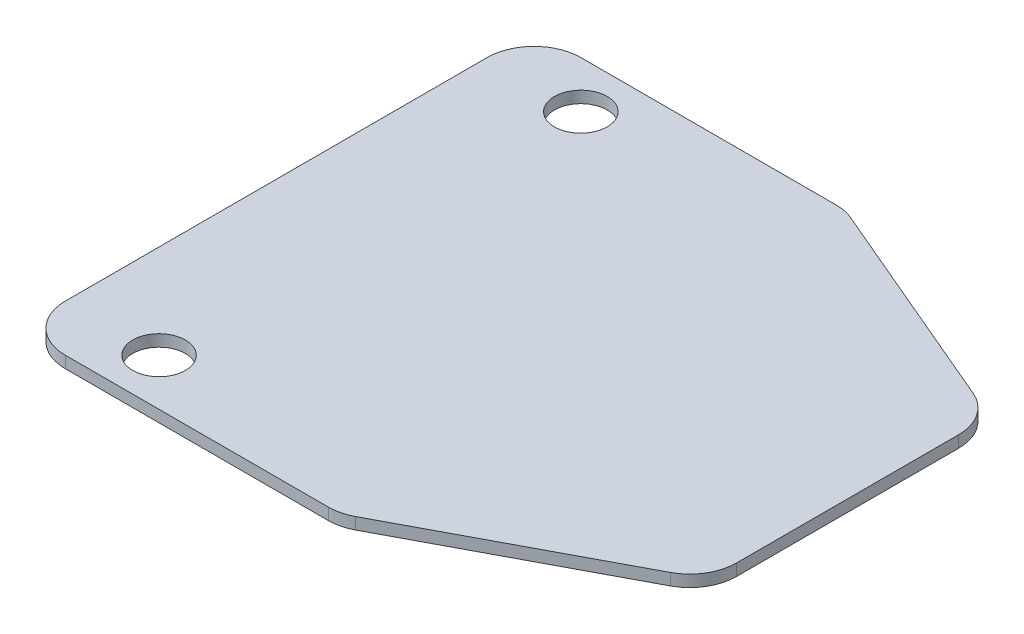
ISO-10303-21;
HEADER;
FILE_DESCRIPTION(('STEP AP214'),'2;1');
FILE_NAME('part.step','',(''),(''),'','','');
FILE_SCHEMA(('AUTOMOTIVE_DESIGN { 1 0 10303 214 1 1 1 1 }'));
ENDSEC;
DATA;
#1=APPLICATION_CONTEXT('core data for automotive mechanical design processes');
#2=APPLICATION_PROTOCOL_DEFINITION('international standard','automotive_design',2000,#1);
#3=PRODUCT_CONTEXT('',#1,'mechanical');
#4=PRODUCT('Part','Part','',(#3));
#5=PRODUCT_RELATED_PRODUCT_CATEGORY('part','',(#4));
#6=PRODUCT_DEFINITION_FORMATION('','',#4);
#7=PRODUCT_DEFINITION_CONTEXT('part definition',#1,'design');
#8=PRODUCT_DEFINITION('design','',#6,#7);
#9=PRODUCT_DEFINITION_SHAPE('','',#8);
#10=(LENGTH_UNIT() NAMED_UNIT(*) SI_UNIT(.MILLI.,.METRE.));
#11=(NAMED_UNIT(*) PLANE_ANGLE_UNIT() SI_UNIT($,.RADIAN.));
#12=(NAMED_UNIT(*) SI_UNIT($,.STERADIAN.) SOLID_ANGLE_UNIT());
#13=UNCERTAINTY_MEASURE_WITH_UNIT(LENGTH_MEASURE(1.E-05),#10,'distance_accuracy_value','');
#14=(GEOMETRIC_REPRESENTATION_CONTEXT(3) GLOBAL_UNCERTAINTY_ASSIGNED_CONTEXT((#13)) GLOBAL_UNIT_ASSIGNED_CONTEXT((#10,
#11,#12)) REPRESENTATION_CONTEXT('',''));
#15=CARTESIAN_POINT('',(0.,0.,0.));
#16=DIRECTION('',(0.,0.,1.));
#17=DIRECTION('',(1.,0.,0.));
#18=AXIS2_PLACEMENT_3D('',#15,#16,#17);
#19=CARTESIAN_POINT('',(0.,6.35,0.));
#20=DIRECTION('',(0.,-1.,0.));
#21=DIRECTION('',(0.,0.,-1.));
#22=AXIS2_PLACEMENT_3D('',#19,#20,#21);
#23=PLANE('',#22);
#24=DIRECTION('',(0.,0.,-1.));
#25=VECTOR('',#24,1.);
#26=CARTESIAN_POINT('',(4.75989238864277,6.35,-211.625159329348));
#27=LINE('',#26,#25);
#28=CARTESIAN_POINT('',(4.75989238864278,6.35,-74.5171086223627));
#29=VERTEX_POINT('',#28);
#30=CARTESIAN_POINT('',(4.75989238864277,6.35,-194.830999422839));
#31=VERTEX_POINT('',#30);
#32=EDGE_CURVE('E268',#29,#31,#27,.T.);
#33=ORIENTED_EDGE('',*,*,#32,.T.);
#34=CARTESIAN_POINT('',(-20.6401076113572,6.35,-194.830999422839));
#35=DIRECTION('',(0.,-1.,0.));
#36=DIRECTION('',(0.,0.,-1.));
#37=AXIS2_PLACEMENT_3D('',#34,#35,#36);
#38=CIRCLE('',#37,25.4);
#39=CARTESIAN_POINT('',(-10.6928325529594,6.35,-218.202172241347));
#40=VERTEX_POINT('',#39);
#41=EDGE_CURVE('E214',#31,#40,#38,.F.);
#42=ORIENTED_EDGE('',*,*,#41,.T.);
#43=DIRECTION('',(-0.920124914114497,0.,-0.391625002299125));
#44=VECTOR('',#43,1.);
#45=CARTESIAN_POINT('',(-131.188630818444,6.35,-269.487781998114));
#46=LINE('',#45,#44);
#47=CARTESIAN_POINT('',(-126.421891143592,6.35,-267.458954816622));
#48=VERTEX_POINT('',#47);
#49=EDGE_CURVE('E155',#40,#48,#46,.T.);
#50=ORIENTED_EDGE('',*,*,#49,.T.);
#51=CARTESIAN_POINT('',(-136.369166201989,6.35,-244.087781998114));
#52=DIRECTION('',(0.,-1.,0.));
#53=DIRECTION('',(0.,0.,-1.));
#54=AXIS2_PLACEMENT_3D('',#51,#52,#53);
#55=CIRCLE('',#54,25.4);
#56=CARTESIAN_POINT('',(-136.369166201989,6.35,-269.487781998114));
#57=VERTEX_POINT('',#56);
#58=EDGE_CURVE('E211',#48,#57,#55,.F.);
#59=ORIENTED_EDGE('',*,*,#58,.T.);
#60=DIRECTION('',(-1.,0.,0.));
#61=VECTOR('',#60,1.);
#62=CARTESIAN_POINT('',(-300.040107611357,6.35,-269.487781998114));
#63=LINE('',#62,#61);
#64=CARTESIAN_POINT('',(-274.640107611357,6.35,-269.487781998114));
#65=VERTEX_POINT('',#64);
#66=EDGE_CURVE('E263',#57,#65,#63,.T.);
#67=ORIENTED_EDGE('',*,*,#66,.T.);
#68=CARTESIAN_POINT('',(-274.640107611357,6.35,-244.087781998114));
#69=DIRECTION('',(0.,-1.,0.));
#70=DIRECTION('',(0.,0.,-1.));
#71=AXIS2_PLACEMENT_3D('',#68,#69,#70);
#72=CIRCLE('',#71,25.4);
#73=CARTESIAN_POINT('',(-300.040107611357,6.35,-244.087781998114));
#74=VERTEX_POINT('',#73);
#75=EDGE_CURVE('E66',#65,#74,#72,.F.);
#76=ORIENTED_EDGE('',*,*,#75,.T.);
#77=DIRECTION('',(0.,0.,1.));
#78=VECTOR('',#77,1.);
#79=CARTESIAN_POINT('',(-300.040107611357,6.35,-269.487781998114));
#80=LINE('',#79,#78);
#81=CARTESIAN_POINT('',(-300.040107611357,6.35,-15.4877819981141));
#82=VERTEX_POINT('',#81);
#83=EDGE_CURVE('E180',#74,#82,#80,.T.);
#84=ORIENTED_EDGE('',*,*,#83,.T.);
#85=CARTESIAN_POINT('',(-274.640107611357,6.35,-15.4877819981141));
#86=DIRECTION('',(0.,-1.,0.));
#87=DIRECTION('',(0.,0.,-1.));
#88=AXIS2_PLACEMENT_3D('',#85,#86,#87);
#89=CIRCLE('',#88,25.4);
#90=CARTESIAN_POINT('',(-274.640107611357,6.35,9.91221800188591));
#91=VERTEX_POINT('',#90);
#92=EDGE_CURVE('E200',#82,#91,#89,.F.);
#93=ORIENTED_EDGE('',*,*,#92,.T.);
#94=DIRECTION('',(1.,0.,0.));
#95=VECTOR('',#94,1.);
#96=CARTESIAN_POINT('',(-300.040107611357,6.35,9.91221800188591));
#97=LINE('',#96,#95);
#98=CARTESIAN_POINT('',(-132.125632794687,6.35,9.91221800188591));
#99=VERTEX_POINT('',#98);
#100=EDGE_CURVE('E178',#91,#99,#97,.T.);
#101=ORIENTED_EDGE('',*,*,#100,.T.);
#102=CARTESIAN_POINT('',(-132.125632794687,6.35,-15.4877819981141));
#103=DIRECTION('',(0.,-1.,0.));
#104=DIRECTION('',(0.,0.,-1.));
#105=AXIS2_PLACEMENT_3D('',#102,#103,#104);
#106=CIRCLE('',#105,25.4);
#107=CARTESIAN_POINT('',(-120.240092917469,6.35,6.95980009499935));
#108=VERTEX_POINT('',#107);
#109=EDGE_CURVE('E203',#99,#108,#106,.F.);
#110=ORIENTED_EDGE('',*,*,#109,.T.);
#111=DIRECTION('',(0.883763074532025,0.,-0.467934640835344));
#112=VECTOR('',#111,1.);
#113=CARTESIAN_POINT('',(-125.816166366606,6.35,9.91221800188591));
#114=LINE('',#113,#112);
#115=CARTESIAN_POINT('',(-8.7545677341395,6.35,-52.0695265292492));
#116=VERTEX_POINT('',#115);
#117=EDGE_CURVE('E272',#108,#116,#114,.T.);
#118=ORIENTED_EDGE('',*,*,#117,.T.);
#119=CARTESIAN_POINT('',(-20.6401076113572,6.35,-74.5171086223627));
#120=DIRECTION('',(0.,-1.,0.));
#121=DIRECTION('',(0.,0.,-1.));
#122=AXIS2_PLACEMENT_3D('',#119,#120,#121);
#123=CIRCLE('',#122,25.4);
#124=EDGE_CURVE('E206',#116,#29,#123,.F.);
#125=ORIENTED_EDGE('',*,*,#124,.T.);
#126=EDGE_LOOP('',(#33,#42,#50,#59,#67,#76,#84,#93,#101,#110,#118,#125));
#127=FACE_BOUND('',#126,.T.);
#128=CARTESIAN_POINT('',(-249.240107611357,6.35,-244.087781998114));
#129=DIRECTION('',(0.,1.,0.));
#130=DIRECTION('',(0.,0.,1.));
#131=AXIS2_PLACEMENT_3D('',#128,#129,#130);
#132=CIRCLE('',#131,14.2875);
#133=CARTESIAN_POINT('',(-249.240107611357,6.35,-229.800281998114));
#134=VERTEX_POINT('',#133);
#135=EDGE_CURVE('E252',#134,#134,#132,.T.);
#136=ORIENTED_EDGE('',*,*,#135,.F.);
#137=EDGE_LOOP('',(#136));
#138=FACE_BOUND('',#137,.T.);
#139=CARTESIAN_POINT('',(-249.240107611357,6.35,-15.4877819981141));
#140=DIRECTION('',(0.,1.,0.));
#141=DIRECTION('',(0.,0.,1.));
#142=AXIS2_PLACEMENT_3D('',#139,#140,#141);
#143=CIRCLE('',#142,14.2875);
#144=CARTESIAN_POINT('',(-249.240107611357,6.35,-1.20028199811406));
#145=VERTEX_POINT('',#144);
#146=EDGE_CURVE('E280',#145,#145,#143,.T.);
#147=ORIENTED_EDGE('',*,*,#146,.F.);
#148=EDGE_LOOP('',(#147));
#149=FACE_BOUND('',#148,.T.);
#150=ADVANCED_FACE('F43',(#127,#138,#149),#23,.F.);
#151=CARTESIAN_POINT('',(0.,0.,0.));
#152=DIRECTION('',(0.,-1.,0.));
#153=DIRECTION('',(0.,0.,-1.));
#154=AXIS2_PLACEMENT_3D('',#151,#152,#153);
#155=PLANE('',#154);
#156=CARTESIAN_POINT('',(-249.240107611357,0.,-244.087781998114));
#157=DIRECTION('',(0.,1.,0.));
#158=DIRECTION('',(0.,0.,1.));
#159=AXIS2_PLACEMENT_3D('',#156,#157,#158);
#160=CIRCLE('',#159,14.2875);
#161=CARTESIAN_POINT('',(-249.240107611357,0.,-229.800281998114));
#162=VERTEX_POINT('',#161);
#163=EDGE_CURVE('E258',#162,#162,#160,.T.);
#164=ORIENTED_EDGE('',*,*,#163,.T.);
#165=EDGE_LOOP('',(#164));
#166=FACE_BOUND('',#165,.T.);
#167=DIRECTION('',(-0.920124914114497,0.,-0.391625002299125));
#168=VECTOR('',#167,1.);
#169=CARTESIAN_POINT('',(-131.188630818444,0.,-269.487781998114));
#170=LINE('',#169,#168);
#171=CARTESIAN_POINT('',(-10.6928325529594,0.,-218.202172241347));
#172=VERTEX_POINT('',#171);
#173=CARTESIAN_POINT('',(-126.421891143592,0.,-267.458954816622));
#174=VERTEX_POINT('',#173);
#175=EDGE_CURVE('E152',#172,#174,#170,.T.);
#176=ORIENTED_EDGE('',*,*,#175,.F.);
#177=CARTESIAN_POINT('',(-20.6401076113572,0.,-194.830999422839));
#178=DIRECTION('',(0.,-1.,0.));
#179=DIRECTION('',(0.,0.,-1.));
#180=AXIS2_PLACEMENT_3D('',#177,#178,#179);
#181=CIRCLE('',#180,25.4);
#182=CARTESIAN_POINT('',(4.75989238864277,0.,-194.830999422839));
#183=VERTEX_POINT('',#182);
#184=EDGE_CURVE('E134',#172,#183,#181,.T.);
#185=ORIENTED_EDGE('',*,*,#184,.T.);
#186=DIRECTION('',(0.,0.,-1.));
#187=VECTOR('',#186,1.);
#188=CARTESIAN_POINT('',(4.75989238864277,0.,-211.625159329348));
#189=LINE('',#188,#187);
#190=CARTESIAN_POINT('',(4.75989238864278,0.,-74.5171086223627));
#191=VERTEX_POINT('',#190);
#192=EDGE_CURVE('E165',#191,#183,#189,.T.);
#193=ORIENTED_EDGE('',*,*,#192,.F.);
#194=CARTESIAN_POINT('',(-20.6401076113572,0.,-74.5171086223627));
#195=DIRECTION('',(0.,-1.,0.));
#196=DIRECTION('',(0.,0.,-1.));
#197=AXIS2_PLACEMENT_3D('',#194,#195,#196);
#198=CIRCLE('',#197,25.4);
#199=CARTESIAN_POINT('',(-8.7545677341395,0.,-52.0695265292492));
#200=VERTEX_POINT('',#199);
#201=EDGE_CURVE('E187',#191,#200,#198,.T.);
#202=ORIENTED_EDGE('',*,*,#201,.T.);
#203=DIRECTION('',(0.883763074532025,0.,-0.467934640835344));
#204=VECTOR('',#203,1.);
#205=CARTESIAN_POINT('',(-125.816166366606,0.,9.91221800188591));
#206=LINE('',#205,#204);
#207=CARTESIAN_POINT('',(-120.240092917469,0.,6.95980009499935));
#208=VERTEX_POINT('',#207);
#209=EDGE_CURVE('E172',#208,#200,#206,.T.);
#210=ORIENTED_EDGE('',*,*,#209,.F.);
#211=CARTESIAN_POINT('',(-132.125632794687,0.,-15.4877819981141));
#212=DIRECTION('',(0.,-1.,0.));
#213=DIRECTION('',(0.,0.,-1.));
#214=AXIS2_PLACEMENT_3D('',#211,#212,#213);
#215=CIRCLE('',#214,25.4);
#216=CARTESIAN_POINT('',(-132.125632794687,0.,9.91221800188591));
#217=VERTEX_POINT('',#216);
#218=EDGE_CURVE('E184',#208,#217,#215,.T.);
#219=ORIENTED_EDGE('',*,*,#218,.T.);
#220=DIRECTION('',(1.,0.,0.));
#221=VECTOR('',#220,1.);
#222=CARTESIAN_POINT('',(-300.040107611357,0.,9.91221800188591));
#223=LINE('',#222,#221);
#224=CARTESIAN_POINT('',(-274.640107611357,0.,9.91221800188591));
#225=VERTEX_POINT('',#224);
#226=EDGE_CURVE('E244',#225,#217,#223,.T.);
#227=ORIENTED_EDGE('',*,*,#226,.F.);
#228=CARTESIAN_POINT('',(-274.640107611357,0.,-15.4877819981141));
#229=DIRECTION('',(0.,-1.,0.));
#230=DIRECTION('',(0.,0.,-1.));
#231=AXIS2_PLACEMENT_3D('',#228,#229,#230);
#232=CIRCLE('',#231,25.4);
#233=CARTESIAN_POINT('',(-300.040107611357,0.,-15.4877819981141));
#234=VERTEX_POINT('',#233);
#235=EDGE_CURVE('E157',#225,#234,#232,.T.);
#236=ORIENTED_EDGE('',*,*,#235,.T.);
#237=DIRECTION('',(0.,0.,1.));
#238=VECTOR('',#237,1.);
#239=CARTESIAN_POINT('',(-300.040107611357,0.,-269.487781998114));
#240=LINE('',#239,#238);
#241=CARTESIAN_POINT('',(-300.040107611357,0.,-244.087781998114));
#242=VERTEX_POINT('',#241);
#243=EDGE_CURVE('E170',#242,#234,#240,.T.);
#244=ORIENTED_EDGE('',*,*,#243,.F.);
#245=CARTESIAN_POINT('',(-274.640107611357,0.,-244.087781998114));
#246=DIRECTION('',(0.,-1.,0.));
#247=DIRECTION('',(0.,0.,-1.));
#248=AXIS2_PLACEMENT_3D('',#245,#246,#247);
#249=CIRCLE('',#248,25.4);
#250=CARTESIAN_POINT('',(-274.640107611357,0.,-269.487781998114));
#251=VERTEX_POINT('',#250);
#252=EDGE_CURVE('E190',#242,#251,#249,.T.);
#253=ORIENTED_EDGE('',*,*,#252,.T.);
#254=DIRECTION('',(-1.,0.,0.));
#255=VECTOR('',#254,1.);
#256=CARTESIAN_POINT('',(-300.040107611357,0.,-269.487781998114));
#257=LINE('',#256,#255);
#258=CARTESIAN_POINT('',(-136.369166201989,0.,-269.487781998114));
#259=VERTEX_POINT('',#258);
#260=EDGE_CURVE('E164',#259,#251,#257,.T.);
#261=ORIENTED_EDGE('',*,*,#260,.F.);
#262=CARTESIAN_POINT('',(-136.369166201989,0.,-244.087781998114));
#263=DIRECTION('',(0.,-1.,0.));
#264=DIRECTION('',(0.,0.,-1.));
#265=AXIS2_PLACEMENT_3D('',#262,#263,#264);
#266=CIRCLE('',#265,25.4);
#267=EDGE_CURVE('E146',#259,#174,#266,.T.);
#268=ORIENTED_EDGE('',*,*,#267,.T.);
#269=EDGE_LOOP('',(#176,#185,#193,#202,#210,#219,#227,#236,#244,#253,#261,#268));
#270=FACE_BOUND('',#269,.T.);
#271=CARTESIAN_POINT('',(-249.240107611357,0.,-15.4877819981141));
#272=DIRECTION('',(0.,1.,0.));
#273=DIRECTION('',(0.,0.,1.));
#274=AXIS2_PLACEMENT_3D('',#271,#272,#273);
#275=CIRCLE('',#274,14.2875);
#276=CARTESIAN_POINT('',(-249.240107611357,0.,-1.20028199811406));
#277=VERTEX_POINT('',#276);
#278=EDGE_CURVE('E282',#277,#277,#275,.T.);
#279=ORIENTED_EDGE('',*,*,#278,.T.);
#280=EDGE_LOOP('',(#279));
#281=FACE_BOUND('',#280,.T.);
#282=ADVANCED_FACE('F160',(#166,#270,#281),#155,.T.);
#283=CARTESIAN_POINT('',(-300.040107611357,6.35,9.91221800188591));
#284=DIRECTION('',(0.,0.,-1.));
#285=DIRECTION('',(-1.,0.,0.));
#286=AXIS2_PLACEMENT_3D('',#283,#284,#285);
#287=PLANE('',#286);
#288=ORIENTED_EDGE('',*,*,#226,.T.);
#289=DIRECTION('',(0.,-1.,0.));
#290=VECTOR('',#289,1.);
#291=CARTESIAN_POINT('',(-132.125632794687,6.35,9.91221800188591));
#292=LINE('',#291,#290);
#293=EDGE_CURVE('E11',#217,#99,#292,.F.);
#294=ORIENTED_EDGE('',*,*,#293,.T.);
#295=ORIENTED_EDGE('',*,*,#100,.F.);
#296=DIRECTION('',(0.,-1.,0.));
#297=VECTOR('',#296,1.);
#298=CARTESIAN_POINT('',(-274.640107611357,6.35,9.91221800188591));
#299=LINE('',#298,#297);
#300=EDGE_CURVE('E52',#91,#225,#299,.T.);
#301=ORIENTED_EDGE('',*,*,#300,.T.);
#302=EDGE_LOOP('',(#288,#294,#295,#301));
#303=FACE_BOUND('',#302,.T.);
#304=ADVANCED_FACE('F243',(#303),#287,.F.);
#305=CARTESIAN_POINT('',(-125.816166366606,6.35,9.91221800188591));
#306=DIRECTION('',(-0.467934640835344,0.,-0.883763074532025));
#307=DIRECTION('',(-0.883763074532025,0.,0.467934640835344));
#308=AXIS2_PLACEMENT_3D('',#305,#306,#307);
#309=PLANE('',#308);
#310=ORIENTED_EDGE('',*,*,#209,.T.);
#311=DIRECTION('',(0.,-1.,0.));
#312=VECTOR('',#311,1.);
#313=CARTESIAN_POINT('',(-8.75456773413948,6.35,-52.0695265292492));
#314=LINE('',#313,#312);
#315=EDGE_CURVE('E234',#200,#116,#314,.F.);
#316=ORIENTED_EDGE('',*,*,#315,.T.);
#317=ORIENTED_EDGE('',*,*,#117,.F.);
#318=DIRECTION('',(0.,-1.,0.));
#319=VECTOR('',#318,1.);
#320=CARTESIAN_POINT('',(-120.240092917469,6.35,6.95980009499935));
#321=LINE('',#320,#319);
#322=EDGE_CURVE('E230',#108,#208,#321,.T.);
#323=ORIENTED_EDGE('',*,*,#322,.T.);
#324=EDGE_LOOP('',(#310,#316,#317,#323));
#325=FACE_BOUND('',#324,.T.);
#326=ADVANCED_FACE('F317',(#325),#309,.F.);
#327=CARTESIAN_POINT('',(4.75989238864277,6.35,-211.625159329348));
#328=DIRECTION('',(-1.,0.,0.));
#329=DIRECTION('',(0.,0.,1.));
#330=AXIS2_PLACEMENT_3D('',#327,#328,#329);
#331=PLANE('',#330);
#332=ORIENTED_EDGE('',*,*,#192,.T.);
#333=DIRECTION('',(0.,-1.,0.));
#334=VECTOR('',#333,1.);
#335=CARTESIAN_POINT('',(4.75989238864277,6.35,-194.830999422839));
#336=LINE('',#335,#334);
#337=EDGE_CURVE('E139',#183,#31,#336,.F.);
#338=ORIENTED_EDGE('',*,*,#337,.T.);
#339=ORIENTED_EDGE('',*,*,#32,.F.);
#340=DIRECTION('',(0.,-1.,0.));
#341=VECTOR('',#340,1.);
#342=CARTESIAN_POINT('',(4.75989238864278,6.35,-74.5171086223627));
#343=LINE('',#342,#341);
#344=EDGE_CURVE('E145',#29,#191,#343,.T.);
#345=ORIENTED_EDGE('',*,*,#344,.T.);
#346=EDGE_LOOP('',(#332,#338,#339,#345));
#347=FACE_BOUND('',#346,.T.);
#348=ADVANCED_FACE('F314',(#347),#331,.F.);
#349=CARTESIAN_POINT('',(-131.188630818444,6.35,-269.487781998114));
#350=DIRECTION('',(-0.391625002299125,0.,0.920124914114497));
#351=DIRECTION('',(0.920124914114497,0.,0.391625002299125));
#352=AXIS2_PLACEMENT_3D('',#349,#350,#351);
#353=PLANE('',#352);
#354=ORIENTED_EDGE('',*,*,#49,.F.);
#355=DIRECTION('',(0.,-1.,0.));
#356=VECTOR('',#355,1.);
#357=CARTESIAN_POINT('',(-10.6928325529594,6.35,-218.202172241347));
#358=LINE('',#357,#356);
#359=EDGE_CURVE('E138',#40,#172,#358,.T.);
#360=ORIENTED_EDGE('',*,*,#359,.T.);
#361=ORIENTED_EDGE('',*,*,#175,.T.);
#362=DIRECTION('',(0.,-1.,0.));
#363=VECTOR('',#362,1.);
#364=CARTESIAN_POINT('',(-126.421891143592,6.35,-267.458954816622));
#365=LINE('',#364,#363);
#366=EDGE_CURVE('E158',#174,#48,#365,.F.);
#367=ORIENTED_EDGE('',*,*,#366,.T.);
#368=EDGE_LOOP('',(#354,#360,#361,#367));
#369=FACE_BOUND('',#368,.T.);
#370=ADVANCED_FACE('F151',(#369),#353,.F.);
#371=CARTESIAN_POINT('',(-300.040107611357,6.35,-269.487781998114));
#372=DIRECTION('',(0.,0.,1.));
#373=DIRECTION('',(1.,0.,0.));
#374=AXIS2_PLACEMENT_3D('',#371,#372,#373);
#375=PLANE('',#374);
#376=ORIENTED_EDGE('',*,*,#66,.F.);
#377=DIRECTION('',(0.,-1.,0.));
#378=VECTOR('',#377,1.);
#379=CARTESIAN_POINT('',(-136.369166201989,6.35,-269.487781998114));
#380=LINE('',#379,#378);
#381=EDGE_CURVE('E220',#57,#259,#380,.T.);
#382=ORIENTED_EDGE('',*,*,#381,.T.);
#383=ORIENTED_EDGE('',*,*,#260,.T.);
#384=DIRECTION('',(0.,-1.,0.));
#385=VECTOR('',#384,1.);
#386=CARTESIAN_POINT('',(-274.640107611357,6.35,-269.487781998114));
#387=LINE('',#386,#385);
#388=EDGE_CURVE('E217',#251,#65,#387,.F.);
#389=ORIENTED_EDGE('',*,*,#388,.T.);
#390=EDGE_LOOP('',(#376,#382,#383,#389));
#391=FACE_BOUND('',#390,.T.);
#392=ADVANCED_FACE('F308',(#391),#375,.F.);
#393=CARTESIAN_POINT('',(-300.040107611357,6.35,-269.487781998114));
#394=DIRECTION('',(1.,0.,0.));
#395=DIRECTION('',(0.,0.,-1.));
#396=AXIS2_PLACEMENT_3D('',#393,#394,#395);
#397=PLANE('',#396);
#398=ORIENTED_EDGE('',*,*,#83,.F.);
#399=DIRECTION('',(0.,-1.,0.));
#400=VECTOR('',#399,1.);
#401=CARTESIAN_POINT('',(-300.040107611357,6.35,-244.087781998114));
#402=LINE('',#401,#400);
#403=EDGE_CURVE('E226',#74,#242,#402,.T.);
#404=ORIENTED_EDGE('',*,*,#403,.T.);
#405=ORIENTED_EDGE('',*,*,#243,.T.);
#406=DIRECTION('',(0.,-1.,0.));
#407=VECTOR('',#406,1.);
#408=CARTESIAN_POINT('',(-300.040107611357,6.35,-15.4877819981141));
#409=LINE('',#408,#407);
#410=EDGE_CURVE('E59',#234,#82,#409,.F.);
#411=ORIENTED_EDGE('',*,*,#410,.T.);
#412=EDGE_LOOP('',(#398,#404,#405,#411));
#413=FACE_BOUND('',#412,.T.);
#414=ADVANCED_FACE('F305',(#413),#397,.F.);
#415=CARTESIAN_POINT('',(-249.240107611357,6.35,-244.087781998114));
#416=DIRECTION('',(0.,-1.,0.));
#417=DIRECTION('',(0.,0.,-1.));
#418=AXIS2_PLACEMENT_3D('',#415,#416,#417);
#419=CYLINDRICAL_SURFACE('',#418,14.2875);
#420=ORIENTED_EDGE('',*,*,#135,.T.);
#421=EDGE_LOOP('',(#420));
#422=FACE_BOUND('',#421,.T.);
#423=ORIENTED_EDGE('',*,*,#163,.F.);
#424=EDGE_LOOP('',(#423));
#425=FACE_BOUND('',#424,.T.);
#426=ADVANCED_FACE('F302',(#422,#425),#419,.F.);
#427=CARTESIAN_POINT('',(-249.240107611357,6.35,-15.4877819981141));
#428=DIRECTION('',(0.,-1.,0.));
#429=DIRECTION('',(0.,0.,-1.));
#430=AXIS2_PLACEMENT_3D('',#427,#428,#429);
#431=CYLINDRICAL_SURFACE('',#430,14.2875);
#432=ORIENTED_EDGE('',*,*,#146,.T.);
#433=EDGE_LOOP('',(#432));
#434=FACE_BOUND('',#433,.T.);
#435=ORIENTED_EDGE('',*,*,#278,.F.);
#436=EDGE_LOOP('',(#435));
#437=FACE_BOUND('',#436,.T.);
#438=ADVANCED_FACE('F290',(#434,#437),#431,.F.);
#439=CARTESIAN_POINT('',(-20.6401076113572,6.35,-194.830999422839));
#440=DIRECTION('',(0.,-1.,0.));
#441=DIRECTION('',(0.,0.,-1.));
#442=AXIS2_PLACEMENT_3D('',#439,#440,#441);
#443=CYLINDRICAL_SURFACE('',#442,25.4);
#444=ORIENTED_EDGE('',*,*,#41,.F.);
#445=ORIENTED_EDGE('',*,*,#337,.F.);
#446=ORIENTED_EDGE('',*,*,#184,.F.);
#447=ORIENTED_EDGE('',*,*,#359,.F.);
#448=EDGE_LOOP('',(#444,#445,#446,#447));
#449=FACE_BOUND('',#448,.T.);
#450=ADVANCED_FACE('F137',(#449),#443,.T.);
#451=CARTESIAN_POINT('',(-136.369166201989,6.35,-244.087781998114));
#452=DIRECTION('',(0.,-1.,0.));
#453=DIRECTION('',(0.,0.,-1.));
#454=AXIS2_PLACEMENT_3D('',#451,#452,#453);
#455=CYLINDRICAL_SURFACE('',#454,25.4);
#456=ORIENTED_EDGE('',*,*,#58,.F.);
#457=ORIENTED_EDGE('',*,*,#366,.F.);
#458=ORIENTED_EDGE('',*,*,#267,.F.);
#459=ORIENTED_EDGE('',*,*,#381,.F.);
#460=EDGE_LOOP('',(#456,#457,#458,#459));
#461=FACE_BOUND('',#460,.T.);
#462=ADVANCED_FACE('F326',(#461),#455,.T.);
#463=CARTESIAN_POINT('',(-274.640107611357,6.35,-244.087781998114));
#464=DIRECTION('',(0.,-1.,0.));
#465=DIRECTION('',(0.,0.,-1.));
#466=AXIS2_PLACEMENT_3D('',#463,#464,#465);
#467=CYLINDRICAL_SURFACE('',#466,25.4);
#468=ORIENTED_EDGE('',*,*,#75,.F.);
#469=ORIENTED_EDGE('',*,*,#388,.F.);
#470=ORIENTED_EDGE('',*,*,#252,.F.);
#471=ORIENTED_EDGE('',*,*,#403,.F.);
#472=EDGE_LOOP('',(#468,#469,#470,#471));
#473=FACE_BOUND('',#472,.T.);
#474=ADVANCED_FACE('F329',(#473),#467,.T.);
#475=CARTESIAN_POINT('',(-20.6401076113572,6.35,-74.5171086223627));
#476=DIRECTION('',(0.,-1.,0.));
#477=DIRECTION('',(0.,0.,-1.));
#478=AXIS2_PLACEMENT_3D('',#475,#476,#477);
#479=CYLINDRICAL_SURFACE('',#478,25.4);
#480=ORIENTED_EDGE('',*,*,#124,.F.);
#481=ORIENTED_EDGE('',*,*,#315,.F.);
#482=ORIENTED_EDGE('',*,*,#201,.F.);
#483=ORIENTED_EDGE('',*,*,#344,.F.);
#484=EDGE_LOOP('',(#480,#481,#482,#483));
#485=FACE_BOUND('',#484,.T.);
#486=ADVANCED_FACE('F333',(#485),#479,.T.);
#487=CARTESIAN_POINT('',(-132.125632794687,6.35,-15.4877819981141));
#488=DIRECTION('',(0.,-1.,0.));
#489=DIRECTION('',(0.,0.,-1.));
#490=AXIS2_PLACEMENT_3D('',#487,#488,#489);
#491=CYLINDRICAL_SURFACE('',#490,25.4);
#492=ORIENTED_EDGE('',*,*,#109,.F.);
#493=ORIENTED_EDGE('',*,*,#293,.F.);
#494=ORIENTED_EDGE('',*,*,#218,.F.);
#495=ORIENTED_EDGE('',*,*,#322,.F.);
#496=EDGE_LOOP('',(#492,#493,#494,#495));
#497=FACE_BOUND('',#496,.T.);
#498=ADVANCED_FACE('F336',(#497),#491,.T.);
#499=CARTESIAN_POINT('',(-274.640107611357,6.35,-15.4877819981141));
#500=DIRECTION('',(0.,-1.,0.));
#501=DIRECTION('',(0.,0.,-1.));
#502=AXIS2_PLACEMENT_3D('',#499,#500,#501);
#503=CYLINDRICAL_SURFACE('',#502,25.4);
#504=ORIENTED_EDGE('',*,*,#92,.F.);
#505=ORIENTED_EDGE('',*,*,#410,.F.);
#506=ORIENTED_EDGE('',*,*,#235,.F.);
#507=ORIENTED_EDGE('',*,*,#300,.F.);
#508=EDGE_LOOP('',(#504,#505,#506,#507));
#509=FACE_BOUND('',#508,.T.);
#510=ADVANCED_FACE('F45',(#509),#503,.T.);
#511=CLOSED_SHELL('',(#150,#282,#304,#326,#348,#370,#392,#414,#426,#438,#450,#462,#474,#486,
#498,#510));
#512=MANIFOLD_SOLID_BREP('B2',#511);
#513=ADVANCED_BREP_SHAPE_REPRESENTATION('',(#18,#512),#14);
#514=SHAPE_DEFINITION_REPRESENTATION(#9,#513);
ENDSEC;
END-ISO-10303-21;
